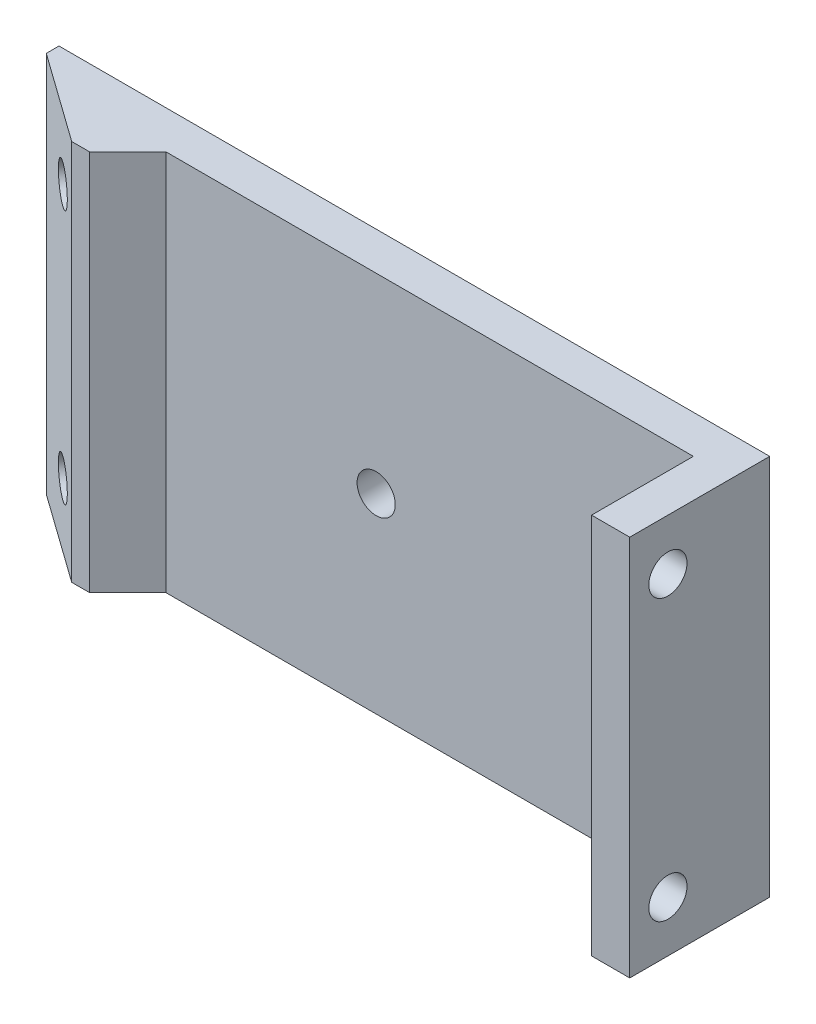
ISO-10303-21;
HEADER;
FILE_DESCRIPTION(('STEP AP214'),'2;1');
FILE_NAME('part.step','',(''),(''),'','','');
FILE_SCHEMA(('AUTOMOTIVE_DESIGN { 1 0 10303 214 1 1 1 1 }'));
ENDSEC;
DATA;
#1=APPLICATION_CONTEXT('core data for automotive mechanical design processes');
#2=APPLICATION_PROTOCOL_DEFINITION('international standard','automotive_design',2000,#1);
#3=PRODUCT_CONTEXT('',#1,'mechanical');
#4=PRODUCT('Part','Part','',(#3));
#5=PRODUCT_RELATED_PRODUCT_CATEGORY('part','',(#4));
#6=PRODUCT_DEFINITION_FORMATION('','',#4);
#7=PRODUCT_DEFINITION_CONTEXT('part definition',#1,'design');
#8=PRODUCT_DEFINITION('design','',#6,#7);
#9=PRODUCT_DEFINITION_SHAPE('','',#8);
#10=(LENGTH_UNIT() NAMED_UNIT(*) SI_UNIT(.MILLI.,.METRE.));
#11=(NAMED_UNIT(*) PLANE_ANGLE_UNIT() SI_UNIT($,.RADIAN.));
#12=(NAMED_UNIT(*) SI_UNIT($,.STERADIAN.) SOLID_ANGLE_UNIT());
#13=UNCERTAINTY_MEASURE_WITH_UNIT(LENGTH_MEASURE(1.E-05),#10,'distance_accuracy_value','');
#14=(GEOMETRIC_REPRESENTATION_CONTEXT(3) GLOBAL_UNCERTAINTY_ASSIGNED_CONTEXT((#13)) GLOBAL_UNIT_ASSIGNED_CONTEXT((#10,
#11,#12)) REPRESENTATION_CONTEXT('',''));
#15=CARTESIAN_POINT('',(0.,0.,0.));
#16=DIRECTION('',(0.,0.,1.));
#17=DIRECTION('',(1.,0.,0.));
#18=AXIS2_PLACEMENT_3D('',#15,#16,#17);
#19=CARTESIAN_POINT('',(0.,0.,3.));
#20=DIRECTION('',(0.,0.,-1.));
#21=DIRECTION('',(-1.,0.,0.));
#22=AXIS2_PLACEMENT_3D('',#19,#20,#21);
#23=PLANE('',#22);
#24=CARTESIAN_POINT('',(0.,0.,3.));
#25=DIRECTION('',(0.,0.,-1.));
#26=DIRECTION('',(-1.,0.,0.));
#27=AXIS2_PLACEMENT_3D('',#24,#25,#26);
#28=CIRCLE('',#27,1.5);
#29=CARTESIAN_POINT('',(-1.5,0.,3.));
#30=VERTEX_POINT('',#29);
#31=EDGE_CURVE('E362',#30,#30,#28,.T.);
#32=ORIENTED_EDGE('',*,*,#31,.T.);
#33=EDGE_LOOP('',(#32));
#34=FACE_BOUND('',#33,.T.);
#35=DIRECTION('',(0.,-1.,0.));
#36=VECTOR('',#35,1.);
#37=CARTESIAN_POINT('',(24.925,15.,3.));
#38=LINE('',#37,#36);
#39=CARTESIAN_POINT('',(24.925,15.,3.));
#40=VERTEX_POINT('',#39);
#41=CARTESIAN_POINT('',(24.925,-15.,3.));
#42=VERTEX_POINT('',#41);
#43=EDGE_CURVE('E53',#40,#42,#38,.T.);
#44=ORIENTED_EDGE('',*,*,#43,.F.);
#45=DIRECTION('',(-1.,0.,0.));
#46=VECTOR('',#45,1.);
#47=CARTESIAN_POINT('',(-27.925,15.,3.));
#48=LINE('',#47,#46);
#49=CARTESIAN_POINT('',(-16.525,15.,3.));
#50=VERTEX_POINT('',#49);
#51=EDGE_CURVE('E295',#40,#50,#48,.T.);
#52=ORIENTED_EDGE('',*,*,#51,.T.);
#53=DIRECTION('',(0.,-1.,0.));
#54=VECTOR('',#53,1.);
#55=CARTESIAN_POINT('',(-16.525,-15.,3.));
#56=LINE('',#55,#54);
#57=CARTESIAN_POINT('',(-16.525,-15.,3.));
#58=VERTEX_POINT('',#57);
#59=EDGE_CURVE('E319',#50,#58,#56,.T.);
#60=ORIENTED_EDGE('',*,*,#59,.T.);
#61=DIRECTION('',(1.,0.,0.));
#62=VECTOR('',#61,1.);
#63=CARTESIAN_POINT('',(-27.925,-15.,3.));
#64=LINE('',#63,#62);
#65=EDGE_CURVE('E58',#58,#42,#64,.T.);
#66=ORIENTED_EDGE('',*,*,#65,.T.);
#67=EDGE_LOOP('',(#44,#52,#60,#66));
#68=FACE_BOUND('',#67,.T.);
#69=ADVANCED_FACE('F35',(#34,#68),#23,.F.);
#70=CARTESIAN_POINT('',(27.925,-15.,3.));
#71=DIRECTION('',(-1.,0.,0.));
#72=DIRECTION('',(0.,0.,1.));
#73=AXIS2_PLACEMENT_3D('',#70,#71,#72);
#74=PLANE('',#73);
#75=CARTESIAN_POINT('',(27.925,11.,8.));
#76=DIRECTION('',(1.,0.,0.));
#77=DIRECTION('',(0.,0.,-1.));
#78=AXIS2_PLACEMENT_3D('',#75,#76,#77);
#79=CIRCLE('',#78,1.5);
#80=CARTESIAN_POINT('',(27.925,11.,6.5));
#81=VERTEX_POINT('',#80);
#82=EDGE_CURVE('E354',#81,#81,#79,.T.);
#83=ORIENTED_EDGE('',*,*,#82,.F.);
#84=EDGE_LOOP('',(#83));
#85=FACE_BOUND('',#84,.T.);
#86=CARTESIAN_POINT('',(27.925,-11.,8.));
#87=DIRECTION('',(1.,0.,0.));
#88=DIRECTION('',(0.,0.,-1.));
#89=AXIS2_PLACEMENT_3D('',#86,#87,#88);
#90=CIRCLE('',#89,1.5);
#91=CARTESIAN_POINT('',(27.925,-11.,6.5));
#92=VERTEX_POINT('',#91);
#93=EDGE_CURVE('E209',#92,#92,#90,.T.);
#94=ORIENTED_EDGE('',*,*,#93,.F.);
#95=EDGE_LOOP('',(#94));
#96=FACE_BOUND('',#95,.T.);
#97=DIRECTION('',(0.,1.,0.));
#98=VECTOR('',#97,1.);
#99=CARTESIAN_POINT('',(27.925,-15.,0.));
#100=LINE('',#99,#98);
#101=CARTESIAN_POINT('',(27.925,-15.,0.));
#102=VERTEX_POINT('',#101);
#103=CARTESIAN_POINT('',(27.925,15.,0.));
#104=VERTEX_POINT('',#103);
#105=EDGE_CURVE('E186',#102,#104,#100,.T.);
#106=ORIENTED_EDGE('',*,*,#105,.T.);
#107=DIRECTION('',(0.,0.,-1.));
#108=VECTOR('',#107,1.);
#109=CARTESIAN_POINT('',(27.925,15.,3.));
#110=LINE('',#109,#108);
#111=CARTESIAN_POINT('',(27.925,15.,11.));
#112=VERTEX_POINT('',#111);
#113=EDGE_CURVE('E179',#112,#104,#110,.T.);
#114=ORIENTED_EDGE('',*,*,#113,.F.);
#115=DIRECTION('',(0.,1.,0.));
#116=VECTOR('',#115,1.);
#117=CARTESIAN_POINT('',(27.925,15.,11.));
#118=LINE('',#117,#116);
#119=CARTESIAN_POINT('',(27.925,-15.,11.));
#120=VERTEX_POINT('',#119);
#121=EDGE_CURVE('E184',#120,#112,#118,.T.);
#122=ORIENTED_EDGE('',*,*,#121,.F.);
#123=DIRECTION('',(0.,0.,-1.));
#124=VECTOR('',#123,1.);
#125=CARTESIAN_POINT('',(27.925,-15.,3.));
#126=LINE('',#125,#124);
#127=EDGE_CURVE('E299',#120,#102,#126,.T.);
#128=ORIENTED_EDGE('',*,*,#127,.T.);
#129=EDGE_LOOP('',(#106,#114,#122,#128));
#130=FACE_BOUND('',#129,.T.);
#131=ADVANCED_FACE('F181',(#85,#96,#130),#74,.F.);
#132=CARTESIAN_POINT('',(-27.925,15.,3.));
#133=DIRECTION('',(0.,-1.,0.));
#134=DIRECTION('',(0.,0.,-1.));
#135=AXIS2_PLACEMENT_3D('',#132,#133,#134);
#136=PLANE('',#135);
#137=DIRECTION('',(0.,0.,-1.));
#138=VECTOR('',#137,1.);
#139=CARTESIAN_POINT('',(-27.925,15.,3.));
#140=LINE('',#139,#138);
#141=CARTESIAN_POINT('',(-27.925,15.,0.999999999999988));
#142=VERTEX_POINT('',#141);
#143=CARTESIAN_POINT('',(-27.925,15.,0.));
#144=VERTEX_POINT('',#143);
#145=EDGE_CURVE('E190',#142,#144,#140,.T.);
#146=ORIENTED_EDGE('',*,*,#145,.F.);
#147=DIRECTION('',(0.813733471206736,0.,0.581238193719096));
#148=VECTOR('',#147,1.);
#149=CARTESIAN_POINT('',(-20.925,15.,6.));
#150=LINE('',#149,#148);
#151=CARTESIAN_POINT('',(-20.925,15.,6.));
#152=VERTEX_POINT('',#151);
#153=EDGE_CURVE('E317',#142,#152,#150,.T.);
#154=ORIENTED_EDGE('',*,*,#153,.T.);
#155=DIRECTION('',(-1.,0.,0.));
#156=VECTOR('',#155,1.);
#157=CARTESIAN_POINT('',(-27.925,15.,6.));
#158=LINE('',#157,#156);
#159=CARTESIAN_POINT('',(-19.525,15.,6.));
#160=VERTEX_POINT('',#159);
#161=EDGE_CURVE('E292',#160,#152,#158,.T.);
#162=ORIENTED_EDGE('',*,*,#161,.F.);
#163=DIRECTION('',(-0.707106781186546,0.,0.707106781186549));
#164=VECTOR('',#163,1.);
#165=CARTESIAN_POINT('',(-22.225,15.,8.69999999999999));
#166=LINE('',#165,#164);
#167=EDGE_CURVE('E321',#160,#50,#166,.F.);
#168=ORIENTED_EDGE('',*,*,#167,.T.);
#169=ORIENTED_EDGE('',*,*,#51,.F.);
#170=DIRECTION('',(0.,0.,-1.));
#171=VECTOR('',#170,1.);
#172=CARTESIAN_POINT('',(24.925,15.,11.));
#173=LINE('',#172,#171);
#174=CARTESIAN_POINT('',(24.925,15.,11.));
#175=VERTEX_POINT('',#174);
#176=EDGE_CURVE('E197',#175,#40,#173,.T.);
#177=ORIENTED_EDGE('',*,*,#176,.F.);
#178=DIRECTION('',(-1.,0.,0.));
#179=VECTOR('',#178,1.);
#180=CARTESIAN_POINT('',(27.925,15.,11.));
#181=LINE('',#180,#179);
#182=EDGE_CURVE('E193',#112,#175,#181,.T.);
#183=ORIENTED_EDGE('',*,*,#182,.F.);
#184=ORIENTED_EDGE('',*,*,#113,.T.);
#185=DIRECTION('',(-1.,0.,0.));
#186=VECTOR('',#185,1.);
#187=CARTESIAN_POINT('',(-27.925,15.,0.));
#188=LINE('',#187,#186);
#189=EDGE_CURVE('E301',#104,#144,#188,.T.);
#190=ORIENTED_EDGE('',*,*,#189,.T.);
#191=EDGE_LOOP('',(#146,#154,#162,#168,#169,#177,#183,#184,#190));
#192=FACE_BOUND('',#191,.T.);
#193=ADVANCED_FACE('F195',(#192),#136,.F.);
#194=CARTESIAN_POINT('',(-27.925,-15.,3.));
#195=DIRECTION('',(1.,0.,0.));
#196=DIRECTION('',(0.,0.,-1.));
#197=AXIS2_PLACEMENT_3D('',#194,#195,#196);
#198=PLANE('',#197);
#199=DIRECTION('',(0.,0.,-1.));
#200=VECTOR('',#199,1.);
#201=CARTESIAN_POINT('',(-27.925,-15.,3.));
#202=LINE('',#201,#200);
#203=CARTESIAN_POINT('',(-27.925,-15.,0.999999999999988));
#204=VERTEX_POINT('',#203);
#205=CARTESIAN_POINT('',(-27.925,-15.,0.));
#206=VERTEX_POINT('',#205);
#207=EDGE_CURVE('E308',#204,#206,#202,.T.);
#208=ORIENTED_EDGE('',*,*,#207,.F.);
#209=DIRECTION('',(0.,1.,0.));
#210=VECTOR('',#209,1.);
#211=CARTESIAN_POINT('',(-27.925,15.,0.999999999999988));
#212=LINE('',#211,#210);
#213=EDGE_CURVE('E315',#204,#142,#212,.T.);
#214=ORIENTED_EDGE('',*,*,#213,.T.);
#215=ORIENTED_EDGE('',*,*,#145,.T.);
#216=DIRECTION('',(0.,-1.,0.));
#217=VECTOR('',#216,1.);
#218=CARTESIAN_POINT('',(-27.925,-15.,0.));
#219=LINE('',#218,#217);
#220=EDGE_CURVE('E303',#144,#206,#219,.T.);
#221=ORIENTED_EDGE('',*,*,#220,.T.);
#222=EDGE_LOOP('',(#208,#214,#215,#221));
#223=FACE_BOUND('',#222,.T.);
#224=ADVANCED_FACE('F407',(#223),#198,.F.);
#225=CARTESIAN_POINT('',(-27.925,-15.,3.));
#226=DIRECTION('',(0.,1.,0.));
#227=DIRECTION('',(0.,0.,1.));
#228=AXIS2_PLACEMENT_3D('',#225,#226,#227);
#229=PLANE('',#228);
#230=DIRECTION('',(1.,0.,0.));
#231=VECTOR('',#230,1.);
#232=CARTESIAN_POINT('',(-27.925,-15.,6.));
#233=LINE('',#232,#231);
#234=CARTESIAN_POINT('',(-20.925,-15.,6.));
#235=VERTEX_POINT('',#234);
#236=CARTESIAN_POINT('',(-19.525,-15.,6.));
#237=VERTEX_POINT('',#236);
#238=EDGE_CURVE('E282',#235,#237,#233,.T.);
#239=ORIENTED_EDGE('',*,*,#238,.F.);
#240=DIRECTION('',(-0.813733471206736,0.,-0.581238193719096));
#241=VECTOR('',#240,1.);
#242=CARTESIAN_POINT('',(-20.925,-15.,6.));
#243=LINE('',#242,#241);
#244=EDGE_CURVE('E313',#235,#204,#243,.T.);
#245=ORIENTED_EDGE('',*,*,#244,.T.);
#246=ORIENTED_EDGE('',*,*,#207,.T.);
#247=DIRECTION('',(1.,0.,0.));
#248=VECTOR('',#247,1.);
#249=CARTESIAN_POINT('',(-27.925,-15.,0.));
#250=LINE('',#249,#248);
#251=EDGE_CURVE('E297',#206,#102,#250,.T.);
#252=ORIENTED_EDGE('',*,*,#251,.T.);
#253=ORIENTED_EDGE('',*,*,#127,.F.);
#254=DIRECTION('',(1.,0.,0.));
#255=VECTOR('',#254,1.);
#256=CARTESIAN_POINT('',(27.925,-15.,11.));
#257=LINE('',#256,#255);
#258=CARTESIAN_POINT('',(24.925,-15.,11.));
#259=VERTEX_POINT('',#258);
#260=EDGE_CURVE('E205',#259,#120,#257,.T.);
#261=ORIENTED_EDGE('',*,*,#260,.F.);
#262=DIRECTION('',(0.,0.,-1.));
#263=VECTOR('',#262,1.);
#264=CARTESIAN_POINT('',(24.925,-15.,11.));
#265=LINE('',#264,#263);
#266=EDGE_CURVE('E213',#259,#42,#265,.T.);
#267=ORIENTED_EDGE('',*,*,#266,.T.);
#268=ORIENTED_EDGE('',*,*,#65,.F.);
#269=DIRECTION('',(0.707106781186546,0.,-0.707106781186549));
#270=VECTOR('',#269,1.);
#271=CARTESIAN_POINT('',(-22.225,-15.,8.7));
#272=LINE('',#271,#270);
#273=EDGE_CURVE('E324',#58,#237,#272,.F.);
#274=ORIENTED_EDGE('',*,*,#273,.T.);
#275=EDGE_LOOP('',(#239,#245,#246,#252,#253,#261,#267,#268,#274));
#276=FACE_BOUND('',#275,.T.);
#277=ADVANCED_FACE('F377',(#276),#229,.F.);
#278=CARTESIAN_POINT('',(0.,0.,0.));
#279=DIRECTION('',(0.,0.,-1.));
#280=DIRECTION('',(-1.,0.,0.));
#281=AXIS2_PLACEMENT_3D('',#278,#279,#280);
#282=PLANE('',#281);
#283=CARTESIAN_POINT('',(0.,0.,0.));
#284=DIRECTION('',(0.,0.,-1.));
#285=DIRECTION('',(-1.,0.,0.));
#286=AXIS2_PLACEMENT_3D('',#283,#284,#285);
#287=CIRCLE('',#286,1.5);
#288=CARTESIAN_POINT('',(-1.5,0.,0.));
#289=VERTEX_POINT('',#288);
#290=EDGE_CURVE('E366',#289,#289,#287,.T.);
#291=ORIENTED_EDGE('',*,*,#290,.F.);
#292=EDGE_LOOP('',(#291));
#293=FACE_BOUND('',#292,.T.);
#294=DIRECTION('',(0.997733088868734,0.0672954929876786,0.));
#295=VECTOR('',#294,1.);
#296=CARTESIAN_POINT('',(-0.948755684325723,14.0663943078237,0.));
#297=LINE('',#296,#295);
#298=CARTESIAN_POINT('',(-22.5496348670579,12.6094497303742,0.));
#299=VERTEX_POINT('',#298);
#300=CARTESIAN_POINT('',(-18.6606781822921,12.8717536072616,0.));
#301=VERTEX_POINT('',#300);
#302=EDGE_CURVE('E11',#299,#301,#297,.T.);
#303=ORIENTED_EDGE('',*,*,#302,.F.);
#304=DIRECTION('',(0.501650752032416,0.865070241648221,0.));
#305=VECTOR('',#304,1.);
#306=CARTESIAN_POINT('',(-22.3469772117653,12.9589221594008,0.));
#307=LINE('',#306,#305);
#308=CARTESIAN_POINT('',(-24.1636048397744,9.82624370774947,0.));
#309=VERTEX_POINT('',#308);
#310=EDGE_CURVE('E343',#309,#299,#307,.T.);
#311=ORIENTED_EDGE('',*,*,#310,.F.);
#312=DIRECTION('',(0.,1.,0.));
#313=VECTOR('',#312,1.);
#314=CARTESIAN_POINT('',(-24.1636048397744,0.,0.));
#315=LINE('',#314,#313);
#316=CARTESIAN_POINT('',(-24.1636048397744,9.67743855523474,0.));
#317=VERTEX_POINT('',#316);
#318=EDGE_CURVE('E341',#317,#309,#315,.T.);
#319=ORIENTED_EDGE('',*,*,#318,.F.);
#320=DIRECTION('',(-0.648597229320531,0.761131811263812,0.));
#321=VECTOR('',#320,1.);
#322=CARTESIAN_POINT('',(-9.22105746075089,-7.85770904847318,0.));
#323=LINE('',#322,#321);
#324=CARTESIAN_POINT('',(-21.9913149037444,7.12824639273845,0.));
#325=VERTEX_POINT('',#324);
#326=EDGE_CURVE('E345',#325,#317,#323,.T.);
#327=ORIENTED_EDGE('',*,*,#326,.F.);
#328=DIRECTION('',(-0.997733088868734,-0.0672954929876776,0.));
#329=VECTOR('',#328,1.);
#330=CARTESIAN_POINT('',(-0.578203122693567,8.57252636078073,0.));
#331=LINE('',#330,#329);
#332=CARTESIAN_POINT('',(-18.1023582189786,7.39055026962578,0.));
#333=VERTEX_POINT('',#332);
#334=EDGE_CURVE('E348',#333,#325,#331,.T.);
#335=ORIENTED_EDGE('',*,*,#334,.F.);
#336=DIRECTION('',(-0.501650752032416,-0.865070241648221,0.));
#337=VECTOR('',#336,1.);
#338=CARTESIAN_POINT('',(-16.7540632122669,9.71561383734437,0.));
#339=LINE('',#338,#337);
#340=CARTESIAN_POINT('',(-16.4370398582525,10.2623038768873,0.));
#341=VERTEX_POINT('',#340);
#342=EDGE_CURVE('E350',#341,#333,#339,.T.);
#343=ORIENTED_EDGE('',*,*,#342,.F.);
#344=DIRECTION('',(0.648597229320532,-0.76113181126381,0.));
#345=VECTOR('',#344,1.);
#346=CARTESIAN_POINT('',(-4.45616192532591,-3.7973111035406,0.));
#347=LINE('',#346,#345);
#348=EDGE_CURVE('E45',#301,#341,#347,.T.);
#349=ORIENTED_EDGE('',*,*,#348,.F.);
#350=EDGE_LOOP('',(#303,#311,#319,#327,#335,#343,#349));
#351=FACE_BOUND('',#350,.T.);
#352=DIRECTION('',(0.997733088868734,-0.0672954929876786,0.));
#353=VECTOR('',#352,1.);
#354=CARTESIAN_POINT('',(-0.578203122693577,-8.57252636078075,0.));
#355=LINE('',#354,#353);
#356=CARTESIAN_POINT('',(-21.9913149037444,-7.12824639273845,0.));
#357=VERTEX_POINT('',#356);
#358=CARTESIAN_POINT('',(-18.1023582189786,-7.39055026962578,0.));
#359=VERTEX_POINT('',#358);
#360=EDGE_CURVE('E339',#357,#359,#355,.T.);
#361=ORIENTED_EDGE('',*,*,#360,.F.);
#362=DIRECTION('',(0.64859722932053,0.761131811263812,0.));
#363=VECTOR('',#362,1.);
#364=CARTESIAN_POINT('',(-9.22105746075091,7.85770904847318,0.));
#365=LINE('',#364,#363);
#366=CARTESIAN_POINT('',(-24.1636048397744,-9.67743855523475,0.));
#367=VERTEX_POINT('',#366);
#368=EDGE_CURVE('E328',#367,#357,#365,.T.);
#369=ORIENTED_EDGE('',*,*,#368,.F.);
#370=DIRECTION('',(0.,1.,0.));
#371=VECTOR('',#370,1.);
#372=CARTESIAN_POINT('',(-24.1636048397744,0.,0.));
#373=LINE('',#372,#371);
#374=CARTESIAN_POINT('',(-24.1636048397744,-9.82624370774947,0.));
#375=VERTEX_POINT('',#374);
#376=EDGE_CURVE('E326',#375,#367,#373,.T.);
#377=ORIENTED_EDGE('',*,*,#376,.F.);
#378=DIRECTION('',(-0.501650752032415,0.865070241648221,0.));
#379=VECTOR('',#378,1.);
#380=CARTESIAN_POINT('',(-22.3469772117654,-12.9589221594008,0.));
#381=LINE('',#380,#379);
#382=CARTESIAN_POINT('',(-22.5496348670579,-12.6094497303742,0.));
#383=VERTEX_POINT('',#382);
#384=EDGE_CURVE('E330',#383,#375,#381,.T.);
#385=ORIENTED_EDGE('',*,*,#384,.F.);
#386=DIRECTION('',(-0.997733088868734,0.0672954929876776,0.));
#387=VECTOR('',#386,1.);
#388=CARTESIAN_POINT('',(-0.948755684325708,-14.0663943078237,0.));
#389=LINE('',#388,#387);
#390=CARTESIAN_POINT('',(-18.6606781822921,-12.8717536072616,0.));
#391=VERTEX_POINT('',#390);
#392=EDGE_CURVE('E333',#391,#383,#389,.T.);
#393=ORIENTED_EDGE('',*,*,#392,.F.);
#394=DIRECTION('',(-0.648597229320531,-0.761131811263812,0.));
#395=VECTOR('',#394,1.);
#396=CARTESIAN_POINT('',(-4.45616192532596,3.79731110354062,0.));
#397=LINE('',#396,#395);
#398=CARTESIAN_POINT('',(-16.4370398582525,-10.2623038768873,0.));
#399=VERTEX_POINT('',#398);
#400=EDGE_CURVE('E335',#399,#391,#397,.T.);
#401=ORIENTED_EDGE('',*,*,#400,.F.);
#402=DIRECTION('',(0.501650752032415,-0.865070241648221,0.));
#403=VECTOR('',#402,1.);
#404=CARTESIAN_POINT('',(-16.7540632122669,-9.71561383734436,0.));
#405=LINE('',#404,#403);
#406=EDGE_CURVE('E337',#359,#399,#405,.T.);
#407=ORIENTED_EDGE('',*,*,#406,.F.);
#408=EDGE_LOOP('',(#361,#369,#377,#385,#393,#401,#407));
#409=FACE_BOUND('',#408,.T.);
#410=ORIENTED_EDGE('',*,*,#105,.F.);
#411=ORIENTED_EDGE('',*,*,#251,.F.);
#412=ORIENTED_EDGE('',*,*,#220,.F.);
#413=ORIENTED_EDGE('',*,*,#189,.F.);
#414=EDGE_LOOP('',(#410,#411,#412,#413));
#415=FACE_BOUND('',#414,.T.);
#416=ADVANCED_FACE('F373',(#293,#351,#409,#415),#282,.T.);
#417=CARTESIAN_POINT('',(0.,0.,6.));
#418=DIRECTION('',(0.,0.,1.));
#419=DIRECTION('',(1.,0.,0.));
#420=AXIS2_PLACEMENT_3D('',#417,#418,#419);
#421=PLANE('',#420);
#422=ORIENTED_EDGE('',*,*,#161,.T.);
#423=DIRECTION('',(0.,-1.,0.));
#424=VECTOR('',#423,1.);
#425=CARTESIAN_POINT('',(-20.925,-15.,6.));
#426=LINE('',#425,#424);
#427=EDGE_CURVE('E189',#152,#235,#426,.T.);
#428=ORIENTED_EDGE('',*,*,#427,.T.);
#429=ORIENTED_EDGE('',*,*,#238,.T.);
#430=DIRECTION('',(0.,1.,0.));
#431=VECTOR('',#430,1.);
#432=CARTESIAN_POINT('',(-19.525,15.,6.));
#433=LINE('',#432,#431);
#434=EDGE_CURVE('E289',#237,#160,#433,.T.);
#435=ORIENTED_EDGE('',*,*,#434,.T.);
#436=EDGE_LOOP('',(#422,#428,#429,#435));
#437=FACE_BOUND('',#436,.T.);
#438=ADVANCED_FACE('F376',(#437),#421,.T.);
#439=CARTESIAN_POINT('',(-20.925,0.,6.));
#440=DIRECTION('',(-0.581238193719096,0.,0.813733471206735));
#441=DIRECTION('',(0.,1.,0.));
#442=AXIS2_PLACEMENT_3D('',#439,#440,#441);
#443=PLANE('',#442);
#444=CARTESIAN_POINT('',(-23.3662004136202,10.,4.25628541884272));
#445=DIRECTION('',(-0.581238193719096,0.,0.813733471206735));
#446=DIRECTION('',(0.813733471206735,0.,0.581238193719096));
#447=AXIS2_PLACEMENT_3D('',#444,#445,#446);
#448=CIRCLE('',#447,1.5);
#449=CARTESIAN_POINT('',(-22.1456002068101,10.,5.12814270942136));
#450=VERTEX_POINT('',#449);
#451=EDGE_CURVE('E279',#450,#450,#448,.T.);
#452=ORIENTED_EDGE('',*,*,#451,.F.);
#453=EDGE_LOOP('',(#452));
#454=FACE_BOUND('',#453,.T.);
#455=CARTESIAN_POINT('',(-23.3662004136202,-10.,4.25628541884272));
#456=DIRECTION('',(-0.581238193719096,0.,0.813733471206735));
#457=DIRECTION('',(0.813733471206735,0.,0.581238193719096));
#458=AXIS2_PLACEMENT_3D('',#455,#456,#457);
#459=CIRCLE('',#458,1.5);
#460=CARTESIAN_POINT('',(-22.1456002068101,-10.,5.12814270942136));
#461=VERTEX_POINT('',#460);
#462=EDGE_CURVE('E278',#461,#461,#459,.T.);
#463=ORIENTED_EDGE('',*,*,#462,.F.);
#464=EDGE_LOOP('',(#463));
#465=FACE_BOUND('',#464,.T.);
#466=ORIENTED_EDGE('',*,*,#153,.F.);
#467=ORIENTED_EDGE('',*,*,#213,.F.);
#468=ORIENTED_EDGE('',*,*,#244,.F.);
#469=ORIENTED_EDGE('',*,*,#427,.F.);
#470=EDGE_LOOP('',(#466,#467,#468,#469));
#471=FACE_BOUND('',#470,.T.);
#472=ADVANCED_FACE('F395',(#454,#465,#471),#443,.T.);
#473=CARTESIAN_POINT('',(-21.6224858324629,-10.,1.81508500522251));
#474=DIRECTION('',(-0.581238193719096,0.,0.813733471206735));
#475=DIRECTION('',(0.813733471206735,0.,0.581238193719096));
#476=AXIS2_PLACEMENT_3D('',#473,#474,#475);
#477=CYLINDRICAL_SURFACE('',#476,1.5);
#478=CARTESIAN_POINT('',(-21.6224858324629,-10.,1.81508500522251));
#479=DIRECTION('',(-0.581238193719096,0.,0.813733471206735));
#480=DIRECTION('',(0.813733471206735,0.,0.581238193719096));
#481=AXIS2_PLACEMENT_3D('',#478,#479,#480);
#482=CIRCLE('',#481,1.5);
#483=CARTESIAN_POINT('',(-20.4018856256528,-10.,2.68694229580115));
#484=VERTEX_POINT('',#483);
#485=EDGE_CURVE('E241',#484,#484,#482,.T.);
#486=ORIENTED_EDGE('',*,*,#485,.F.);
#487=EDGE_LOOP('',(#486));
#488=FACE_BOUND('',#487,.T.);
#489=ORIENTED_EDGE('',*,*,#462,.T.);
#490=EDGE_LOOP('',(#489));
#491=FACE_BOUND('',#490,.T.);
#492=ADVANCED_FACE('F428',(#488,#491),#477,.F.);
#493=CARTESIAN_POINT('',(-21.6224858324629,10.,1.81508500522251));
#494=DIRECTION('',(-0.581238193719096,0.,0.813733471206735));
#495=DIRECTION('',(0.813733471206735,0.,0.581238193719096));
#496=AXIS2_PLACEMENT_3D('',#493,#494,#495);
#497=CYLINDRICAL_SURFACE('',#496,1.5);
#498=CARTESIAN_POINT('',(-21.6224858324629,10.,1.81508500522251));
#499=DIRECTION('',(-0.581238193719096,0.,0.813733471206735));
#500=DIRECTION('',(0.813733471206735,0.,0.581238193719096));
#501=AXIS2_PLACEMENT_3D('',#498,#499,#500);
#502=CIRCLE('',#501,1.5);
#503=CARTESIAN_POINT('',(-20.4018856256528,10.,2.68694229580115));
#504=VERTEX_POINT('',#503);
#505=EDGE_CURVE('E275',#504,#504,#502,.T.);
#506=ORIENTED_EDGE('',*,*,#505,.F.);
#507=EDGE_LOOP('',(#506));
#508=FACE_BOUND('',#507,.T.);
#509=ORIENTED_EDGE('',*,*,#451,.T.);
#510=EDGE_LOOP('',(#509));
#511=FACE_BOUND('',#510,.T.);
#512=ADVANCED_FACE('F431',(#508,#511),#497,.F.);
#513=CARTESIAN_POINT('',(-19.525,15.,6.));
#514=DIRECTION('',(0.707106781186549,0.,0.707106781186546));
#515=DIRECTION('',(0.,-1.,0.));
#516=AXIS2_PLACEMENT_3D('',#513,#514,#515);
#517=PLANE('',#516);
#518=ORIENTED_EDGE('',*,*,#273,.F.);
#519=ORIENTED_EDGE('',*,*,#59,.F.);
#520=ORIENTED_EDGE('',*,*,#167,.F.);
#521=ORIENTED_EDGE('',*,*,#434,.F.);
#522=EDGE_LOOP('',(#518,#519,#520,#521));
#523=FACE_BOUND('',#522,.T.);
#524=ADVANCED_FACE('F38',(#523),#517,.T.);
#525=CARTESIAN_POINT('',(-14.3974603157706,-10.2623038768873,-2.85541135947458));
#526=DIRECTION('',(0.735914386809501,0.426753791543072,0.525653133435357));
#527=DIRECTION('',(0.581238193719096,0.,-0.813733471206735));
#528=AXIS2_PLACEMENT_3D('',#525,#526,#527);
#529=PLANE('',#528);
#530=ORIENTED_EDGE('',*,*,#406,.T.);
#531=DIRECTION('',(-0.581238193719096,0.,0.813733471206735));
#532=VECTOR('',#531,1.);
#533=CARTESIAN_POINT('',(-14.3974603157706,-10.2623038768873,-2.85541135947458));
#534=LINE('',#533,#532);
#535=CARTESIAN_POINT('',(-19.0473658655234,-10.2623038768873,3.6544564101793));
#536=VERTEX_POINT('',#535);
#537=EDGE_CURVE('E223',#399,#536,#534,.T.);
#538=ORIENTED_EDGE('',*,*,#537,.T.);
#539=DIRECTION('',(-0.347263844142979,0.904367846290221,-0.248045602959271));
#540=VECTOR('',#539,1.);
#541=CARTESIAN_POINT('',(-19.0473658655234,-10.2623038768873,3.6544564101793));
#542=LINE('',#541,#540);
#543=CARTESIAN_POINT('',(-20.1500766719501,-7.39055026962578,2.86680583416019));
#544=VERTEX_POINT('',#543);
#545=EDGE_CURVE('E218',#536,#544,#542,.T.);
#546=ORIENTED_EDGE('',*,*,#545,.T.);
#547=DIRECTION('',(-0.581238193719096,0.,0.813733471206735));
#548=VECTOR('',#547,1.);
#549=CARTESIAN_POINT('',(-15.5001711221974,-7.39055026962578,-3.64306193549369));
#550=LINE('',#549,#548);
#551=EDGE_CURVE('E266',#359,#544,#550,.T.);
#552=ORIENTED_EDGE('',*,*,#551,.F.);
#553=EDGE_LOOP('',(#530,#538,#546,#552));
#554=FACE_BOUND('',#553,.T.);
#555=ADVANCED_FACE('F436',(#554),#529,.F.);
#556=CARTESIAN_POINT('',(-15.8698694762834,-12.8717536072616,-3.90713218841226));
#557=DIRECTION('',(0.668696504248411,-0.569828633481614,0.477640360177436));
#558=DIRECTION('',(0.648597229320531,0.761131811263812,0.));
#559=AXIS2_PLACEMENT_3D('',#556,#557,#558);
#560=PLANE('',#559);
#561=ORIENTED_EDGE('',*,*,#400,.T.);
#562=DIRECTION('',(-0.581238193719096,0.,0.813733471206735));
#563=VECTOR('',#562,1.);
#564=CARTESIAN_POINT('',(-15.8698694762834,-12.8717536072616,-3.90713218841226));
#565=LINE('',#564,#563);
#566=CARTESIAN_POINT('',(-20.5197750260361,-12.8717536072616,2.60273558124163));
#567=VERTEX_POINT('',#566);
#568=EDGE_CURVE('E268',#391,#567,#565,.T.);
#569=ORIENTED_EDGE('',*,*,#568,.T.);
#570=DIRECTION('',(0.463688631915984,0.821763547782741,0.331206165654275));
#571=VECTOR('',#570,1.);
#572=CARTESIAN_POINT('',(-20.5197750260361,-12.8717536072616,2.60273558124163));
#573=LINE('',#572,#571);
#574=EDGE_CURVE('E263',#567,#536,#573,.T.);
#575=ORIENTED_EDGE('',*,*,#574,.T.);
#576=ORIENTED_EDGE('',*,*,#537,.F.);
#577=EDGE_LOOP('',(#561,#569,#575,#576));
#578=FACE_BOUND('',#577,.T.);
#579=ADVANCED_FACE('F439',(#578),#560,.F.);
#580=CARTESIAN_POINT('',(-18.4449894432229,-12.6094497303742,-5.74650359336904));
#581=DIRECTION('',(-0.0672178825610894,-0.996582425024688,-0.0480127732579209));
#582=DIRECTION('',(0.997733088868734,-0.0672954929876776,0.));
#583=AXIS2_PLACEMENT_3D('',#580,#581,#582);
#584=PLANE('',#583);
#585=ORIENTED_EDGE('',*,*,#392,.T.);
#586=DIRECTION('',(-0.581238193719096,0.,0.813733471206735));
#587=VECTOR('',#586,1.);
#588=CARTESIAN_POINT('',(-18.4449894432229,-12.6094497303742,-5.74650359336904));
#589=LINE('',#588,#587);
#590=CARTESIAN_POINT('',(-23.0948949929756,-12.6094497303742,0.763364176284846));
#591=VERTEX_POINT('',#590);
#592=EDGE_CURVE('E270',#383,#591,#589,.T.);
#593=ORIENTED_EDGE('',*,*,#592,.T.);
#594=DIRECTION('',(0.810952476058966,-0.0826042985074805,0.579251768613545));
#595=VECTOR('',#594,1.);
#596=CARTESIAN_POINT('',(-23.0948949929756,-12.6094497303742,0.763364176284846));
#597=LINE('',#596,#595);
#598=EDGE_CURVE('E260',#591,#567,#597,.T.);
#599=ORIENTED_EDGE('',*,*,#598,.T.);
#600=ORIENTED_EDGE('',*,*,#568,.F.);
#601=EDGE_LOOP('',(#585,#593,#599,#600));
#602=FACE_BOUND('',#601,.T.);
#603=ADVANCED_FACE('F453',(#602),#584,.F.);
#604=CARTESIAN_POINT('',(-19.5477002496496,-9.73769612311267,-6.53415416938815));
#605=DIRECTION('',(-0.735914386809501,-0.426753791543072,-0.525653133435357));
#606=DIRECTION('',(-0.581238193719096,0.,0.813733471206735));
#607=AXIS2_PLACEMENT_3D('',#604,#605,#606);
#608=PLANE('',#607);
#609=ORIENTED_EDGE('',*,*,#384,.T.);
#610=DIRECTION('',(0.347263844142979,-0.904367846290221,0.248045602959271));
#611=VECTOR('',#610,1.);
#612=CARTESIAN_POINT('',(-24.1976057994024,-9.73769612311267,-0.024286399734264));
#613=LINE('',#612,#611);
#614=EDGE_CURVE('E257',#375,#591,#613,.T.);
#615=ORIENTED_EDGE('',*,*,#614,.T.);
#616=ORIENTED_EDGE('',*,*,#592,.F.);
#617=EDGE_LOOP('',(#609,#615,#616));
#618=FACE_BOUND('',#617,.T.);
#619=ADVANCED_FACE('F449',(#618),#608,.F.);
#620=CARTESIAN_POINT('',(-18.0752910891369,-7.12824639273845,-5.48243334045048));
#621=DIRECTION('',(-0.668696504248412,0.569828633481614,-0.477640360177436));
#622=DIRECTION('',(-0.64859722932053,-0.761131811263812,0.));
#623=AXIS2_PLACEMENT_3D('',#620,#621,#622);
#624=PLANE('',#623);
#625=ORIENTED_EDGE('',*,*,#368,.T.);
#626=DIRECTION('',(-0.581238193719096,0.,0.813733471206735));
#627=VECTOR('',#626,1.);
#628=CARTESIAN_POINT('',(-18.0752910891369,-7.12824639273845,-5.48243334045048));
#629=LINE('',#628,#627);
#630=CARTESIAN_POINT('',(-22.7251966388897,-7.12824639273845,1.02743442920341));
#631=VERTEX_POINT('',#630);
#632=EDGE_CURVE('E272',#357,#631,#629,.T.);
#633=ORIENTED_EDGE('',*,*,#632,.T.);
#634=DIRECTION('',(-0.463688631915984,-0.821763547782741,-0.331206165654274));
#635=VECTOR('',#634,1.);
#636=CARTESIAN_POINT('',(-22.7251966388897,-7.12824639273845,1.02743442920341));
#637=LINE('',#636,#635);
#638=EDGE_CURVE('E254',#631,#367,#637,.T.);
#639=ORIENTED_EDGE('',*,*,#638,.T.);
#640=EDGE_LOOP('',(#625,#633,#639));
#641=FACE_BOUND('',#640,.T.);
#642=ADVANCED_FACE('F445',(#641),#624,.F.);
#643=CARTESIAN_POINT('',(-15.5001711221974,-7.39055026962578,-3.64306193549369));
#644=DIRECTION('',(0.0672178825610904,0.996582425024688,0.0480127732579216));
#645=DIRECTION('',(-0.997733088868734,0.0672954929876786,0.));
#646=AXIS2_PLACEMENT_3D('',#643,#644,#645);
#647=PLANE('',#646);
#648=ORIENTED_EDGE('',*,*,#360,.T.);
#649=ORIENTED_EDGE('',*,*,#551,.T.);
#650=DIRECTION('',(-0.810952476058965,0.0826042985074817,-0.579251768613546));
#651=VECTOR('',#650,1.);
#652=CARTESIAN_POINT('',(-20.1500766719501,-7.39055026962578,2.86680583416019));
#653=LINE('',#652,#651);
#654=EDGE_CURVE('E251',#544,#631,#653,.T.);
#655=ORIENTED_EDGE('',*,*,#654,.T.);
#656=ORIENTED_EDGE('',*,*,#632,.F.);
#657=EDGE_LOOP('',(#648,#649,#655,#656));
#658=FACE_BOUND('',#657,.T.);
#659=ADVANCED_FACE('F441',(#658),#647,.F.);
#660=CARTESIAN_POINT('',(-8.16338001343728,0.,11.4287320188122));
#661=DIRECTION('',(-0.581238193719096,0.,0.813733471206735));
#662=DIRECTION('',(0.813733471206735,0.,0.581238193719096));
#663=AXIS2_PLACEMENT_3D('',#660,#661,#662);
#664=PLANE('',#663);
#665=ORIENTED_EDGE('',*,*,#485,.T.);
#666=EDGE_LOOP('',(#665));
#667=FACE_BOUND('',#666,.T.);
#668=ORIENTED_EDGE('',*,*,#376,.T.);
#669=ORIENTED_EDGE('',*,*,#638,.F.);
#670=ORIENTED_EDGE('',*,*,#654,.F.);
#671=ORIENTED_EDGE('',*,*,#545,.F.);
#672=ORIENTED_EDGE('',*,*,#574,.F.);
#673=ORIENTED_EDGE('',*,*,#598,.F.);
#674=ORIENTED_EDGE('',*,*,#614,.F.);
#675=EDGE_LOOP('',(#668,#669,#670,#671,#672,#673,#674));
#676=FACE_BOUND('',#675,.T.);
#677=ADVANCED_FACE('F444',(#667,#676),#664,.F.);
#678=CARTESIAN_POINT('',(-18.0752910891369,7.12824639273845,-5.48243334045048));
#679=DIRECTION('',(0.0672178825610894,-0.996582425024688,0.0480127732579209));
#680=DIRECTION('',(0.997733088868734,0.0672954929876776,0.));
#681=AXIS2_PLACEMENT_3D('',#678,#679,#680);
#682=PLANE('',#681);
#683=ORIENTED_EDGE('',*,*,#334,.T.);
#684=DIRECTION('',(-0.581238193719096,0.,0.813733471206735));
#685=VECTOR('',#684,1.);
#686=CARTESIAN_POINT('',(-18.0752910891369,7.12824639273845,-5.48243334045048));
#687=LINE('',#686,#685);
#688=CARTESIAN_POINT('',(-22.7251966388897,7.12824639273845,1.02743442920341));
#689=VERTEX_POINT('',#688);
#690=EDGE_CURVE('E239',#325,#689,#687,.T.);
#691=ORIENTED_EDGE('',*,*,#690,.T.);
#692=DIRECTION('',(0.810952476058965,0.0826042985074804,0.579251768613546));
#693=VECTOR('',#692,1.);
#694=CARTESIAN_POINT('',(-22.7251966388897,7.12824639273845,1.02743442920341));
#695=LINE('',#694,#693);
#696=CARTESIAN_POINT('',(-20.1500766719501,7.39055026962578,2.86680583416019));
#697=VERTEX_POINT('',#696);
#698=EDGE_CURVE('E219',#689,#697,#695,.T.);
#699=ORIENTED_EDGE('',*,*,#698,.T.);
#700=DIRECTION('',(-0.581238193719096,0.,0.813733471206735));
#701=VECTOR('',#700,1.);
#702=CARTESIAN_POINT('',(-15.5001711221974,7.39055026962578,-3.64306193549369));
#703=LINE('',#702,#701);
#704=EDGE_CURVE('E238',#333,#697,#703,.T.);
#705=ORIENTED_EDGE('',*,*,#704,.F.);
#706=EDGE_LOOP('',(#683,#691,#699,#705));
#707=FACE_BOUND('',#706,.T.);
#708=ADVANCED_FACE('F463',(#707),#682,.F.);
#709=CARTESIAN_POINT('',(-19.5477002496496,9.73769612311267,-6.53415416938815));
#710=DIRECTION('',(-0.668696504248411,-0.569828633481614,-0.477640360177436));
#711=DIRECTION('',(0.648597229320531,-0.761131811263812,0.));
#712=AXIS2_PLACEMENT_3D('',#709,#710,#711);
#713=PLANE('',#712);
#714=ORIENTED_EDGE('',*,*,#326,.T.);
#715=DIRECTION('',(0.463688631915985,-0.82176354778274,0.331206165654274));
#716=VECTOR('',#715,1.);
#717=CARTESIAN_POINT('',(-24.1976057994024,9.73769612311267,-0.0242863997342675));
#718=LINE('',#717,#716);
#719=EDGE_CURVE('E235',#317,#689,#718,.T.);
#720=ORIENTED_EDGE('',*,*,#719,.T.);
#721=ORIENTED_EDGE('',*,*,#690,.F.);
#722=EDGE_LOOP('',(#714,#720,#721));
#723=FACE_BOUND('',#722,.T.);
#724=ADVANCED_FACE('F467',(#723),#713,.F.);
#725=CARTESIAN_POINT('',(-18.4449894432229,12.6094497303742,-5.74650359336904));
#726=DIRECTION('',(-0.7359143868095,0.426753791543073,-0.525653133435357));
#727=DIRECTION('',(-0.581238193719096,0.,0.813733471206735));
#728=AXIS2_PLACEMENT_3D('',#725,#726,#727);
#729=PLANE('',#728);
#730=ORIENTED_EDGE('',*,*,#310,.T.);
#731=DIRECTION('',(-0.581238193719096,0.,0.813733471206735));
#732=VECTOR('',#731,1.);
#733=CARTESIAN_POINT('',(-18.4449894432229,12.6094497303742,-5.74650359336904));
#734=LINE('',#733,#732);
#735=CARTESIAN_POINT('',(-23.0948949929756,12.6094497303742,0.763364176284843));
#736=VERTEX_POINT('',#735);
#737=EDGE_CURVE('E242',#299,#736,#734,.T.);
#738=ORIENTED_EDGE('',*,*,#737,.T.);
#739=DIRECTION('',(-0.34726384414298,-0.90436784629022,-0.248045602959271));
#740=VECTOR('',#739,1.);
#741=CARTESIAN_POINT('',(-23.0948949929756,12.6094497303742,0.763364176284843));
#742=LINE('',#741,#740);
#743=EDGE_CURVE('E232',#736,#309,#742,.T.);
#744=ORIENTED_EDGE('',*,*,#743,.T.);
#745=EDGE_LOOP('',(#730,#738,#744));
#746=FACE_BOUND('',#745,.T.);
#747=ADVANCED_FACE('F481',(#746),#729,.F.);
#748=CARTESIAN_POINT('',(-15.8698694762834,12.8717536072616,-3.90713218841226));
#749=DIRECTION('',(-0.0672178825610904,0.996582425024688,-0.0480127732579216));
#750=DIRECTION('',(-0.997733088868734,-0.0672954929876786,0.));
#751=AXIS2_PLACEMENT_3D('',#748,#749,#750);
#752=PLANE('',#751);
#753=ORIENTED_EDGE('',*,*,#302,.T.);
#754=DIRECTION('',(-0.581238193719096,0.,0.813733471206735));
#755=VECTOR('',#754,1.);
#756=CARTESIAN_POINT('',(-15.8698694762834,12.8717536072616,-3.90713218841226));
#757=LINE('',#756,#755);
#758=CARTESIAN_POINT('',(-20.5197750260361,12.8717536072616,2.60273558124163));
#759=VERTEX_POINT('',#758);
#760=EDGE_CURVE('E244',#301,#759,#757,.T.);
#761=ORIENTED_EDGE('',*,*,#760,.T.);
#762=DIRECTION('',(-0.810952476058964,-0.0826042985074816,-0.579251768613546));
#763=VECTOR('',#762,1.);
#764=CARTESIAN_POINT('',(-20.5197750260361,12.8717536072616,2.60273558124163));
#765=LINE('',#764,#763);
#766=EDGE_CURVE('E229',#759,#736,#765,.T.);
#767=ORIENTED_EDGE('',*,*,#766,.T.);
#768=ORIENTED_EDGE('',*,*,#737,.F.);
#769=EDGE_LOOP('',(#753,#761,#767,#768));
#770=FACE_BOUND('',#769,.T.);
#771=ADVANCED_FACE('F477',(#770),#752,.F.);
#772=CARTESIAN_POINT('',(-14.3974603157706,10.2623038768873,-2.85541135947458));
#773=DIRECTION('',(0.66869650424841,0.569828633481616,0.477640360177435));
#774=DIRECTION('',(-0.648597229320532,0.76113181126381,0.));
#775=AXIS2_PLACEMENT_3D('',#772,#773,#774);
#776=PLANE('',#775);
#777=ORIENTED_EDGE('',*,*,#348,.T.);
#778=DIRECTION('',(-0.581238193719096,0.,0.813733471206735));
#779=VECTOR('',#778,1.);
#780=CARTESIAN_POINT('',(-14.3974603157706,10.2623038768873,-2.85541135947458));
#781=LINE('',#780,#779);
#782=CARTESIAN_POINT('',(-19.0473658655234,10.2623038768873,3.6544564101793));
#783=VERTEX_POINT('',#782);
#784=EDGE_CURVE('E246',#341,#783,#781,.T.);
#785=ORIENTED_EDGE('',*,*,#784,.T.);
#786=DIRECTION('',(-0.463688631915986,0.821763547782739,-0.331206165654275));
#787=VECTOR('',#786,1.);
#788=CARTESIAN_POINT('',(-19.0473658655234,10.2623038768873,3.6544564101793));
#789=LINE('',#788,#787);
#790=EDGE_CURVE('E226',#783,#759,#789,.T.);
#791=ORIENTED_EDGE('',*,*,#790,.T.);
#792=ORIENTED_EDGE('',*,*,#760,.F.);
#793=EDGE_LOOP('',(#777,#785,#791,#792));
#794=FACE_BOUND('',#793,.T.);
#795=ADVANCED_FACE('F473',(#794),#776,.F.);
#796=CARTESIAN_POINT('',(-15.5001711221974,7.39055026962578,-3.64306193549369));
#797=DIRECTION('',(0.735914386809501,-0.426753791543072,0.525653133435357));
#798=DIRECTION('',(0.581238193719096,0.,-0.813733471206735));
#799=AXIS2_PLACEMENT_3D('',#796,#797,#798);
#800=PLANE('',#799);
#801=ORIENTED_EDGE('',*,*,#342,.T.);
#802=ORIENTED_EDGE('',*,*,#704,.T.);
#803=DIRECTION('',(0.34726384414298,0.904367846290221,0.248045602959271));
#804=VECTOR('',#803,1.);
#805=CARTESIAN_POINT('',(-20.1500766719501,7.39055026962578,2.86680583416019));
#806=LINE('',#805,#804);
#807=EDGE_CURVE('E222',#697,#783,#806,.T.);
#808=ORIENTED_EDGE('',*,*,#807,.T.);
#809=ORIENTED_EDGE('',*,*,#784,.F.);
#810=EDGE_LOOP('',(#801,#802,#808,#809));
#811=FACE_BOUND('',#810,.T.);
#812=ADVANCED_FACE('F469',(#811),#800,.F.);
#813=CARTESIAN_POINT('',(-8.16338001343729,0.,11.4287320188122));
#814=DIRECTION('',(-0.581238193719096,0.,0.813733471206735));
#815=DIRECTION('',(0.813733471206735,0.,0.581238193719096));
#816=AXIS2_PLACEMENT_3D('',#813,#814,#815);
#817=PLANE('',#816);
#818=ORIENTED_EDGE('',*,*,#505,.T.);
#819=EDGE_LOOP('',(#818));
#820=FACE_BOUND('',#819,.T.);
#821=ORIENTED_EDGE('',*,*,#318,.T.);
#822=ORIENTED_EDGE('',*,*,#743,.F.);
#823=ORIENTED_EDGE('',*,*,#766,.F.);
#824=ORIENTED_EDGE('',*,*,#790,.F.);
#825=ORIENTED_EDGE('',*,*,#807,.F.);
#826=ORIENTED_EDGE('',*,*,#698,.F.);
#827=ORIENTED_EDGE('',*,*,#719,.F.);
#828=EDGE_LOOP('',(#821,#822,#823,#824,#825,#826,#827));
#829=FACE_BOUND('',#828,.T.);
#830=ADVANCED_FACE('F472',(#820,#829),#817,.F.);
#831=CARTESIAN_POINT('',(24.925,15.,11.));
#832=DIRECTION('',(1.,0.,0.));
#833=DIRECTION('',(0.,1.,0.));
#834=AXIS2_PLACEMENT_3D('',#831,#832,#833);
#835=PLANE('',#834);
#836=CARTESIAN_POINT('',(24.925,11.,8.));
#837=DIRECTION('',(1.,0.,0.));
#838=DIRECTION('',(0.,1.,0.));
#839=AXIS2_PLACEMENT_3D('',#836,#837,#838);
#840=CIRCLE('',#839,1.5);
#841=CARTESIAN_POINT('',(24.925,12.5,8.));
#842=VERTEX_POINT('',#841);
#843=EDGE_CURVE('E40',#842,#842,#840,.T.);
#844=ORIENTED_EDGE('',*,*,#843,.T.);
#845=EDGE_LOOP('',(#844));
#846=FACE_BOUND('',#845,.T.);
#847=CARTESIAN_POINT('',(24.925,-11.,8.));
#848=DIRECTION('',(1.,0.,0.));
#849=DIRECTION('',(0.,1.,0.));
#850=AXIS2_PLACEMENT_3D('',#847,#848,#849);
#851=CIRCLE('',#850,1.5);
#852=CARTESIAN_POINT('',(24.925,-9.5,8.));
#853=VERTEX_POINT('',#852);
#854=EDGE_CURVE('E352',#853,#853,#851,.T.);
#855=ORIENTED_EDGE('',*,*,#854,.T.);
#856=EDGE_LOOP('',(#855));
#857=FACE_BOUND('',#856,.T.);
#858=ORIENTED_EDGE('',*,*,#43,.T.);
#859=ORIENTED_EDGE('',*,*,#266,.F.);
#860=DIRECTION('',(0.,-1.,0.));
#861=VECTOR('',#860,1.);
#862=CARTESIAN_POINT('',(24.925,15.,11.));
#863=LINE('',#862,#861);
#864=EDGE_CURVE('E200',#175,#259,#863,.T.);
#865=ORIENTED_EDGE('',*,*,#864,.F.);
#866=ORIENTED_EDGE('',*,*,#176,.T.);
#867=EDGE_LOOP('',(#858,#859,#865,#866));
#868=FACE_BOUND('',#867,.T.);
#869=ADVANCED_FACE('F405',(#846,#857,#868),#835,.F.);
#870=CARTESIAN_POINT('',(0.,0.,11.));
#871=DIRECTION('',(0.,0.,-1.));
#872=DIRECTION('',(-1.,0.,0.));
#873=AXIS2_PLACEMENT_3D('',#870,#871,#872);
#874=PLANE('',#873);
#875=ORIENTED_EDGE('',*,*,#121,.T.);
#876=ORIENTED_EDGE('',*,*,#182,.T.);
#877=ORIENTED_EDGE('',*,*,#864,.T.);
#878=ORIENTED_EDGE('',*,*,#260,.T.);
#879=EDGE_LOOP('',(#875,#876,#877,#878));
#880=FACE_BOUND('',#879,.T.);
#881=ADVANCED_FACE('F203',(#880),#874,.F.);
#882=CARTESIAN_POINT('',(19.925,-11.,8.));
#883=DIRECTION('',(1.,0.,0.));
#884=DIRECTION('',(0.,0.,-1.));
#885=AXIS2_PLACEMENT_3D('',#882,#883,#884);
#886=CYLINDRICAL_SURFACE('',#885,1.5);
#887=ORIENTED_EDGE('',*,*,#93,.T.);
#888=EDGE_LOOP('',(#887));
#889=FACE_BOUND('',#888,.T.);
#890=ORIENTED_EDGE('',*,*,#854,.F.);
#891=EDGE_LOOP('',(#890));
#892=FACE_BOUND('',#891,.T.);
#893=ADVANCED_FACE('F497',(#889,#892),#886,.F.);
#894=CARTESIAN_POINT('',(19.925,11.,8.));
#895=DIRECTION('',(1.,0.,0.));
#896=DIRECTION('',(0.,0.,-1.));
#897=AXIS2_PLACEMENT_3D('',#894,#895,#896);
#898=CYLINDRICAL_SURFACE('',#897,1.5);
#899=ORIENTED_EDGE('',*,*,#82,.T.);
#900=EDGE_LOOP('',(#899));
#901=FACE_BOUND('',#900,.T.);
#902=ORIENTED_EDGE('',*,*,#843,.F.);
#903=EDGE_LOOP('',(#902));
#904=FACE_BOUND('',#903,.T.);
#905=ADVANCED_FACE('F500',(#901,#904),#898,.F.);
#906=CARTESIAN_POINT('',(0.,0.,11.));
#907=DIRECTION('',(0.,0.,-1.));
#908=DIRECTION('',(-1.,0.,0.));
#909=AXIS2_PLACEMENT_3D('',#906,#907,#908);
#910=CYLINDRICAL_SURFACE('',#909,1.5);
#911=ORIENTED_EDGE('',*,*,#290,.T.);
#912=EDGE_LOOP('',(#911));
#913=FACE_BOUND('',#912,.T.);
#914=ORIENTED_EDGE('',*,*,#31,.F.);
#915=EDGE_LOOP('',(#914));
#916=FACE_BOUND('',#915,.T.);
#917=ADVANCED_FACE('F370',(#913,#916),#910,.F.);
#918=CLOSED_SHELL('',(#69,#131,#193,#224,#277,#416,#438,#472,#492,#512,#524,#555,#579,#603,#619,
#642,#659,#677,#708,#724,#747,#771,#795,#812,#830,#869,#881,#893,#905,#917));
#919=MANIFOLD_SOLID_BREP('B2',#918);
#920=ADVANCED_BREP_SHAPE_REPRESENTATION('',(#18,#919),#14);
#921=SHAPE_DEFINITION_REPRESENTATION(#9,#920);
ENDSEC;
END-ISO-10303-21;
